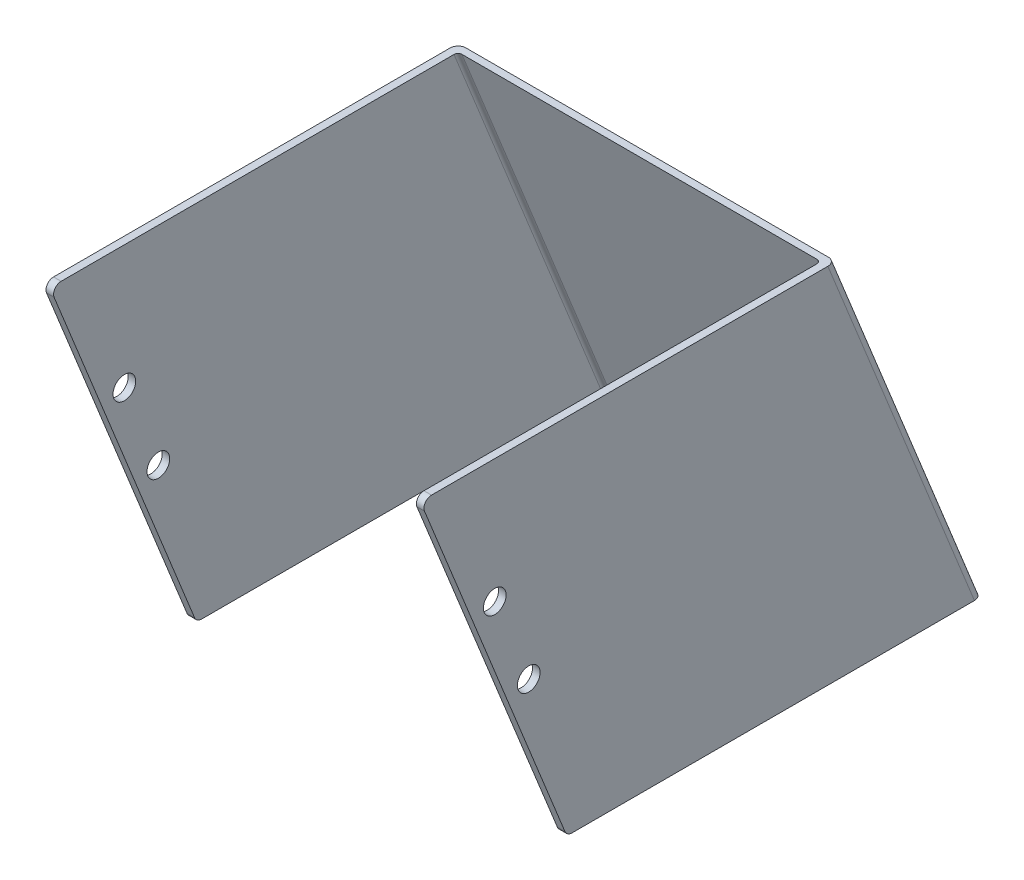
ISO-10303-21;
HEADER;
FILE_DESCRIPTION(('STEP AP214'),'2;1');
FILE_NAME('part.step','',(''),(''),'','','');
FILE_SCHEMA(('AUTOMOTIVE_DESIGN { 1 0 10303 214 1 1 1 1 }'));
ENDSEC;
DATA;
#1=APPLICATION_CONTEXT('core data for automotive mechanical design processes');
#2=APPLICATION_PROTOCOL_DEFINITION('international standard','automotive_design',2000,#1);
#3=PRODUCT_CONTEXT('',#1,'mechanical');
#4=PRODUCT('Part','Part','',(#3));
#5=PRODUCT_RELATED_PRODUCT_CATEGORY('part','',(#4));
#6=PRODUCT_DEFINITION_FORMATION('','',#4);
#7=PRODUCT_DEFINITION_CONTEXT('part definition',#1,'design');
#8=PRODUCT_DEFINITION('design','',#6,#7);
#9=PRODUCT_DEFINITION_SHAPE('','',#8);
#10=(LENGTH_UNIT() NAMED_UNIT(*) SI_UNIT(.MILLI.,.METRE.));
#11=(NAMED_UNIT(*) PLANE_ANGLE_UNIT() SI_UNIT($,.RADIAN.));
#12=(NAMED_UNIT(*) SI_UNIT($,.STERADIAN.) SOLID_ANGLE_UNIT());
#13=UNCERTAINTY_MEASURE_WITH_UNIT(LENGTH_MEASURE(1.E-05),#10,'distance_accuracy_value','');
#14=(GEOMETRIC_REPRESENTATION_CONTEXT(3) GLOBAL_UNCERTAINTY_ASSIGNED_CONTEXT((#13)) GLOBAL_UNIT_ASSIGNED_CONTEXT((#10,
#11,#12)) REPRESENTATION_CONTEXT('',''));
#15=CARTESIAN_POINT('',(0.,0.,0.));
#16=DIRECTION('',(0.,0.,1.));
#17=DIRECTION('',(1.,0.,0.));
#18=AXIS2_PLACEMENT_3D('',#15,#16,#17);
#19=CARTESIAN_POINT('',(-79.375,-87.3125,-45.5495832672248));
#20=DIRECTION('',(1.,0.,0.));
#21=DIRECTION('',(0.,0.,-1.));
#22=AXIS2_PLACEMENT_3D('',#19,#20,#21);
#23=CYLINDRICAL_SURFACE('',#22,4.7625);
#24=CARTESIAN_POINT('',(-76.2,-87.3125,-45.5495832672248));
#25=DIRECTION('',(1.,0.,0.));
#26=DIRECTION('',(0.,0.,-1.));
#27=AXIS2_PLACEMENT_3D('',#24,#25,#26);
#28=CIRCLE('',#27,4.7625);
#29=CARTESIAN_POINT('',(-76.2,-87.3125,-50.3120832672248));
#30=VERTEX_POINT('',#29);
#31=EDGE_CURVE('E144',#30,#30,#28,.F.);
#32=ORIENTED_EDGE('',*,*,#31,.F.);
#33=EDGE_LOOP('',(#32));
#34=FACE_BOUND('',#33,.T.);
#35=CARTESIAN_POINT('',(-79.375,-87.3125,-45.5495832672248));
#36=DIRECTION('',(1.,0.,0.));
#37=DIRECTION('',(0.,0.,-1.));
#38=AXIS2_PLACEMENT_3D('',#35,#36,#37);
#39=CIRCLE('',#38,4.7625);
#40=CARTESIAN_POINT('',(-79.375,-87.3125,-50.3120832672248));
#41=VERTEX_POINT('',#40);
#42=EDGE_CURVE('E224',#41,#41,#39,.F.);
#43=ORIENTED_EDGE('',*,*,#42,.T.);
#44=EDGE_LOOP('',(#43));
#45=FACE_BOUND('',#44,.T.);
#46=ADVANCED_FACE('F16',(#34,#45),#23,.F.);
#47=CARTESIAN_POINT('',(-79.375,-51.98679514101,-31.2770720581006));
#48=DIRECTION('',(1.,0.,0.));
#49=DIRECTION('',(0.,0.,-1.));
#50=AXIS2_PLACEMENT_3D('',#47,#48,#49);
#51=CYLINDRICAL_SURFACE('',#50,4.7625);
#52=CARTESIAN_POINT('',(-76.2,-51.98679514101,-31.2770720581006));
#53=DIRECTION('',(1.,0.,0.));
#54=DIRECTION('',(0.,0.,-1.));
#55=AXIS2_PLACEMENT_3D('',#52,#53,#54);
#56=CIRCLE('',#55,4.7625);
#57=CARTESIAN_POINT('',(-76.2,-51.98679514101,-36.0395720581006));
#58=VERTEX_POINT('',#57);
#59=EDGE_CURVE('E231',#58,#58,#56,.F.);
#60=ORIENTED_EDGE('',*,*,#59,.F.);
#61=EDGE_LOOP('',(#60));
#62=FACE_BOUND('',#61,.T.);
#63=CARTESIAN_POINT('',(-79.375,-51.98679514101,-31.2770720581006));
#64=DIRECTION('',(1.,0.,0.));
#65=DIRECTION('',(0.,0.,-1.));
#66=AXIS2_PLACEMENT_3D('',#63,#64,#65);
#67=CIRCLE('',#66,4.7625);
#68=CARTESIAN_POINT('',(-79.375,-51.98679514101,-36.0395720581006));
#69=VERTEX_POINT('',#68);
#70=EDGE_CURVE('E158',#69,#69,#67,.F.);
#71=ORIENTED_EDGE('',*,*,#70,.T.);
#72=EDGE_LOOP('',(#71));
#73=FACE_BOUND('',#72,.T.);
#74=ADVANCED_FACE('F239',(#62,#73),#51,.F.);
#75=CARTESIAN_POINT('',(-79.375,0.,0.));
#76=DIRECTION('',(0.,-0.374606593415897,0.927183854566793));
#77=DIRECTION('',(0.,-0.927183854566793,-0.374606593415897));
#78=AXIS2_PLACEMENT_3D('',#75,#76,#77);
#79=PLANE('',#78);
#80=DIRECTION('',(0.,-0.927183854566809,-0.374606593415858));
#81=VECTOR('',#80,1.);
#82=CARTESIAN_POINT('',(-79.375,-4.3643759340958,-1.7633223367783));
#83=LINE('',#82,#81);
#84=CARTESIAN_POINT('',(-79.375,-4.36437593409558,-1.76332233677841));
#85=VERTEX_POINT('',#84);
#86=CARTESIAN_POINT('',(-79.375,-150.414375934096,-60.7713526199949));
#87=VERTEX_POINT('',#86);
#88=EDGE_CURVE('E132',#85,#87,#83,.T.);
#89=ORIENTED_EDGE('',*,*,#88,.T.);
#90=DIRECTION('',(-1.,0.,0.));
#91=VECTOR('',#90,1.);
#92=CARTESIAN_POINT('',(286.3215,-150.414375934094,-60.7713526199964));
#93=LINE('',#92,#91);
#94=CARTESIAN_POINT('',(-76.2,-150.414375934096,-60.7713526199949));
#95=VERTEX_POINT('',#94);
#96=EDGE_CURVE('E125',#95,#87,#93,.T.);
#97=ORIENTED_EDGE('',*,*,#96,.F.);
#98=DIRECTION('',(0.,-0.927183854566809,-0.374606593415858));
#99=VECTOR('',#98,1.);
#100=CARTESIAN_POINT('',(-76.2,-4.3643759340958,-1.7633223367783));
#101=LINE('',#100,#99);
#102=CARTESIAN_POINT('',(-76.2,-4.36437593409558,-1.76332233677841));
#103=VERTEX_POINT('',#102);
#104=EDGE_CURVE('E129',#103,#95,#101,.T.);
#105=ORIENTED_EDGE('',*,*,#104,.F.);
#106=DIRECTION('',(-1.,0.,0.));
#107=VECTOR('',#106,1.);
#108=CARTESIAN_POINT('',(286.3215,-4.36437593409566,-1.76332233677865));
#109=LINE('',#108,#107);
#110=EDGE_CURVE('E157',#85,#103,#109,.F.);
#111=ORIENTED_EDGE('',*,*,#110,.F.);
#112=EDGE_LOOP('',(#89,#97,#105,#111));
#113=FACE_BOUND('',#112,.T.);
#114=ADVANCED_FACE('F127',(#113),#79,.T.);
#115=CARTESIAN_POINT('',(286.3215,-149.225,-63.7151613582464));
#116=DIRECTION('',(-1.,0.,0.));
#117=DIRECTION('',(0.,0.,1.));
#118=AXIS2_PLACEMENT_3D('',#115,#116,#117);
#119=CYLINDRICAL_SURFACE('',#118,3.175);
#120=ORIENTED_EDGE('',*,*,#96,.T.);
#121=CARTESIAN_POINT('',(-79.375,-149.225,-63.7151613582464));
#122=DIRECTION('',(-1.,0.,0.));
#123=DIRECTION('',(0.,0.,1.));
#124=AXIS2_PLACEMENT_3D('',#121,#122,#123);
#125=CIRCLE('',#124,3.175);
#126=CARTESIAN_POINT('',(-79.375,-152.4,-63.7151613582464));
#127=VERTEX_POINT('',#126);
#128=EDGE_CURVE('E227',#87,#127,#125,.F.);
#129=ORIENTED_EDGE('',*,*,#128,.T.);
#130=DIRECTION('',(1.,0.,0.));
#131=VECTOR('',#130,1.);
#132=CARTESIAN_POINT('',(-79.375,-152.4,-63.7151613582464));
#133=LINE('',#132,#131);
#134=CARTESIAN_POINT('',(-76.2,-152.4,-63.7151613582464));
#135=VERTEX_POINT('',#134);
#136=EDGE_CURVE('E140',#135,#127,#133,.F.);
#137=ORIENTED_EDGE('',*,*,#136,.F.);
#138=CARTESIAN_POINT('',(-76.2,-149.225,-63.7151613582464));
#139=DIRECTION('',(-1.,0.,0.));
#140=DIRECTION('',(0.,0.,1.));
#141=AXIS2_PLACEMENT_3D('',#138,#139,#140);
#142=CIRCLE('',#141,3.175);
#143=EDGE_CURVE('E19',#95,#135,#142,.F.);
#144=ORIENTED_EDGE('',*,*,#143,.F.);
#145=EDGE_LOOP('',(#120,#129,#137,#144));
#146=FACE_BOUND('',#145,.T.);
#147=ADVANCED_FACE('F138',(#146),#119,.T.);
#148=CARTESIAN_POINT('',(-76.2,0.,0.));
#149=DIRECTION('',(1.,0.,0.));
#150=DIRECTION('',(0.,0.,-1.));
#151=AXIS2_PLACEMENT_3D('',#148,#149,#150);
#152=PLANE('',#151);
#153=ORIENTED_EDGE('',*,*,#59,.T.);
#154=EDGE_LOOP('',(#153));
#155=FACE_BOUND('',#154,.T.);
#156=ORIENTED_EDGE('',*,*,#31,.T.);
#157=EDGE_LOOP('',(#156));
#158=FACE_BOUND('',#157,.T.);
#159=ORIENTED_EDGE('',*,*,#104,.T.);
#160=ORIENTED_EDGE('',*,*,#143,.T.);
#161=DIRECTION('',(0.,0.,-1.));
#162=VECTOR('',#161,1.);
#163=CARTESIAN_POINT('',(-76.2,-152.4,-61.5735968172794));
#164=LINE('',#163,#162);
#165=CARTESIAN_POINT('',(-76.2,-152.4,-231.311422913274));
#166=VERTEX_POINT('',#165);
#167=EDGE_CURVE('E156',#166,#135,#164,.F.);
#168=ORIENTED_EDGE('',*,*,#167,.F.);
#169=DIRECTION('',(0.,-0.927183854566793,-0.374606593415897));
#170=VECTOR('',#169,1.);
#171=CARTESIAN_POINT('',(-76.2,198.668640000009,-89.4704852850089));
#172=LINE('',#171,#170);
#173=CARTESIAN_POINT('',(-76.2,0.,-169.737826095999));
#174=VERTEX_POINT('',#173);
#175=EDGE_CURVE('E152',#166,#174,#172,.F.);
#176=ORIENTED_EDGE('',*,*,#175,.T.);
#177=DIRECTION('',(0.,0.,1.));
#178=VECTOR('',#177,1.);
#179=CARTESIAN_POINT('',(-76.2,0.,-174.625));
#180=LINE('',#179,#178);
#181=CARTESIAN_POINT('',(-76.2,0.,-4.70713107502815));
#182=VERTEX_POINT('',#181);
#183=EDGE_CURVE('E200',#182,#174,#180,.F.);
#184=ORIENTED_EDGE('',*,*,#183,.F.);
#185=CARTESIAN_POINT('',(-76.2,-3.175,-4.70713107502814));
#186=DIRECTION('',(-1.,0.,0.));
#187=DIRECTION('',(0.,0.,1.));
#188=AXIS2_PLACEMENT_3D('',#185,#186,#187);
#189=CIRCLE('',#188,3.175);
#190=EDGE_CURVE('E147',#103,#182,#189,.T.);
#191=ORIENTED_EDGE('',*,*,#190,.F.);
#192=EDGE_LOOP('',(#159,#160,#168,#176,#184,#191));
#193=FACE_BOUND('',#192,.T.);
#194=ADVANCED_FACE('F145',(#155,#158,#193),#152,.T.);
#195=CARTESIAN_POINT('',(-74.6125,198.66864,-89.470485284986));
#196=DIRECTION('',(0.,-0.927183854566793,-0.374606593415897));
#197=DIRECTION('',(0.,0.374606593415897,-0.927183854566793));
#198=AXIS2_PLACEMENT_3D('',#195,#196,#197);
#199=CYLINDRICAL_SURFACE('',#198,1.5875);
#200=DIRECTION('',(0.,0.927183854566793,0.374606593415897));
#201=VECTOR('',#200,1.);
#202=CARTESIAN_POINT('',(-74.6125,-152.4,-233.023596817279));
#203=LINE('',#202,#201);
#204=CARTESIAN_POINT('',(-74.6125,-152.4,-233.02359681727));
#205=VERTEX_POINT('',#204);
#206=CARTESIAN_POINT('',(-74.6125,0.,-171.449999999995));
#207=VERTEX_POINT('',#206);
#208=EDGE_CURVE('E290',#205,#207,#203,.T.);
#209=ORIENTED_EDGE('',*,*,#208,.T.);
#210=CARTESIAN_POINT('',(-74.6125,0.,-169.737826095986));
#211=DIRECTION('',(0.,1.,0.));
#212=DIRECTION('',(0.,0.,-1.));
#213=AXIS2_PLACEMENT_3D('',#210,#211,#212);
#214=ELLIPSE('',#213,1.71217390400065,1.5875);
#215=EDGE_CURVE('E197',#174,#207,#214,.F.);
#216=ORIENTED_EDGE('',*,*,#215,.F.);
#217=ORIENTED_EDGE('',*,*,#175,.F.);
#218=CARTESIAN_POINT('',(-74.6125,-152.4,-231.311422913261));
#219=DIRECTION('',(0.,-1.,0.));
#220=DIRECTION('',(0.,0.,-1.));
#221=AXIS2_PLACEMENT_3D('',#218,#219,#220);
#222=ELLIPSE('',#221,1.71217390400065,1.5875);
#223=EDGE_CURVE('E209',#205,#166,#222,.F.);
#224=ORIENTED_EDGE('',*,*,#223,.F.);
#225=EDGE_LOOP('',(#209,#216,#217,#224));
#226=FACE_BOUND('',#225,.T.);
#227=ADVANCED_FACE('F295',(#226),#199,.F.);
#228=CARTESIAN_POINT('',(-76.2,-152.4,-233.023596817279));
#229=DIRECTION('',(0.,0.374606593415897,-0.927183854566793));
#230=DIRECTION('',(0.,0.927183854566793,0.374606593415897));
#231=AXIS2_PLACEMENT_3D('',#228,#229,#230);
#232=PLANE('',#231);
#233=DIRECTION('',(0.,0.927183854566793,0.374606593415897));
#234=VECTOR('',#233,1.);
#235=CARTESIAN_POINT('',(74.6125,-350.473952032952,-313.050668093511));
#236=LINE('',#235,#234);
#237=CARTESIAN_POINT('',(74.6125,-152.399999999991,-233.023596817356));
#238=VERTEX_POINT('',#237);
#239=CARTESIAN_POINT('',(74.6125,9.70057367766231E-12,-171.45000000008));
#240=VERTEX_POINT('',#239);
#241=EDGE_CURVE('E288',#238,#240,#236,.T.);
#242=ORIENTED_EDGE('',*,*,#241,.T.);
#243=DIRECTION('',(1.,0.,0.));
#244=VECTOR('',#243,1.);
#245=CARTESIAN_POINT('',(-79.375,0.,-171.45));
#246=LINE('',#245,#244);
#247=EDGE_CURVE('E196',#207,#240,#246,.T.);
#248=ORIENTED_EDGE('',*,*,#247,.F.);
#249=ORIENTED_EDGE('',*,*,#208,.F.);
#250=DIRECTION('',(1.,0.,0.));
#251=VECTOR('',#250,1.);
#252=CARTESIAN_POINT('',(-79.375,-152.4,-233.023596817279));
#253=LINE('',#252,#251);
#254=EDGE_CURVE('E212',#238,#205,#253,.F.);
#255=ORIENTED_EDGE('',*,*,#254,.F.);
#256=EDGE_LOOP('',(#242,#248,#249,#255));
#257=FACE_BOUND('',#256,.T.);
#258=ADVANCED_FACE('F298',(#257),#232,.F.);
#259=CARTESIAN_POINT('',(74.6125,-351.06864,-311.578763724386));
#260=DIRECTION('',(0.,0.927183854566793,0.374606593415897));
#261=DIRECTION('',(0.,-0.374606593415897,0.927183854566793));
#262=AXIS2_PLACEMENT_3D('',#259,#260,#261);
#263=CYLINDRICAL_SURFACE('',#262,1.5875);
#264=ORIENTED_EDGE('',*,*,#241,.F.);
#265=CARTESIAN_POINT('',(74.6125,-152.4,-231.311422913386));
#266=DIRECTION('',(0.,-1.,0.));
#267=DIRECTION('',(0.,0.,1.));
#268=AXIS2_PLACEMENT_3D('',#265,#266,#267);
#269=ELLIPSE('',#268,1.71217390400065,1.5875);
#270=CARTESIAN_POINT('',(76.2,-152.4,-231.311422913337));
#271=VERTEX_POINT('',#270);
#272=EDGE_CURVE('E213',#271,#238,#269,.F.);
#273=ORIENTED_EDGE('',*,*,#272,.F.);
#274=DIRECTION('',(0.,0.927183854566784,0.37460659341592));
#275=VECTOR('',#274,1.);
#276=CARTESIAN_POINT('',(76.2,-152.4,-231.311422913288));
#277=LINE('',#276,#275);
#278=CARTESIAN_POINT('',(76.2,0.,-169.73782609606));
#279=VERTEX_POINT('',#278);
#280=EDGE_CURVE('E220',#271,#279,#277,.T.);
#281=ORIENTED_EDGE('',*,*,#280,.T.);
#282=CARTESIAN_POINT('',(74.6125,0.,-169.737826096111));
#283=DIRECTION('',(0.,1.,0.));
#284=DIRECTION('',(0.,0.,1.));
#285=AXIS2_PLACEMENT_3D('',#282,#283,#284);
#286=ELLIPSE('',#285,1.71217390400065,1.5875);
#287=EDGE_CURVE('E193',#240,#279,#286,.F.);
#288=ORIENTED_EDGE('',*,*,#287,.F.);
#289=EDGE_LOOP('',(#264,#273,#281,#288));
#290=FACE_BOUND('',#289,.T.);
#291=ADVANCED_FACE('F302',(#290),#263,.F.);
#292=CARTESIAN_POINT('',(-79.375,-152.4,-236.198596817279));
#293=DIRECTION('',(0.,0.374606593415897,-0.927183854566793));
#294=DIRECTION('',(0.,0.927183854566793,0.374606593415897));
#295=AXIS2_PLACEMENT_3D('',#292,#293,#294);
#296=PLANE('',#295);
#297=DIRECTION('',(1.,0.,0.));
#298=VECTOR('',#297,1.);
#299=CARTESIAN_POINT('',(-79.375,-152.4,-236.198596817279));
#300=LINE('',#299,#298);
#301=CARTESIAN_POINT('',(-76.2,-152.400000000001,-236.198596817273));
#302=VERTEX_POINT('',#301);
#303=CARTESIAN_POINT('',(76.2,-152.399999999996,-236.198596817308));
#304=VERTEX_POINT('',#303);
#305=EDGE_CURVE('E205',#302,#304,#300,.T.);
#306=ORIENTED_EDGE('',*,*,#305,.F.);
#307=DIRECTION('',(0.,-0.927183854566793,-0.374606593415897));
#308=VECTOR('',#307,1.);
#309=CARTESIAN_POINT('',(-76.2,199.858015934095,-93.8771201192438));
#310=LINE('',#309,#308);
#311=CARTESIAN_POINT('',(-76.2,-4.02455846426619E-13,-174.624999999997));
#312=VERTEX_POINT('',#311);
#313=EDGE_CURVE('E230',#312,#302,#310,.T.);
#314=ORIENTED_EDGE('',*,*,#313,.F.);
#315=DIRECTION('',(1.,0.,0.));
#316=VECTOR('',#315,1.);
#317=CARTESIAN_POINT('',(-79.375,0.,-174.625));
#318=LINE('',#317,#316);
#319=CARTESIAN_POINT('',(76.2,3.8441472227646E-12,-174.625000000032));
#320=VERTEX_POINT('',#319);
#321=EDGE_CURVE('E188',#320,#312,#318,.F.);
#322=ORIENTED_EDGE('',*,*,#321,.F.);
#323=DIRECTION('',(0.,0.927183854566793,0.374606593415897));
#324=VECTOR('',#323,1.);
#325=CARTESIAN_POINT('',(76.2,-349.879264065905,-315.985398558568));
#326=LINE('',#325,#324);
#327=EDGE_CURVE('E204',#304,#320,#326,.T.);
#328=ORIENTED_EDGE('',*,*,#327,.F.);
#329=EDGE_LOOP('',(#306,#314,#322,#328));
#330=FACE_BOUND('',#329,.T.);
#331=ADVANCED_FACE('F339',(#330),#296,.T.);
#332=CARTESIAN_POINT('',(-76.2,198.66864,-90.9333113809942));
#333=DIRECTION('',(0.,-0.927183854566793,-0.374606593415897));
#334=DIRECTION('',(0.,0.374606593415897,-0.927183854566793));
#335=AXIS2_PLACEMENT_3D('',#332,#333,#334);
#336=CYLINDRICAL_SURFACE('',#335,3.175);
#337=ORIENTED_EDGE('',*,*,#313,.T.);
#338=CARTESIAN_POINT('',(-76.2,-152.4,-232.774249009269));
#339=DIRECTION('',(0.,-1.,0.));
#340=DIRECTION('',(0.,0.,-1.));
#341=AXIS2_PLACEMENT_3D('',#338,#339,#340);
#342=ELLIPSE('',#341,3.42434780800131,3.175);
#343=CARTESIAN_POINT('',(-79.375,-152.4,-232.77424900927));
#344=VERTEX_POINT('',#343);
#345=EDGE_CURVE('E206',#344,#302,#342,.T.);
#346=ORIENTED_EDGE('',*,*,#345,.F.);
#347=DIRECTION('',(0.,0.927183854566784,0.37460659341592));
#348=VECTOR('',#347,1.);
#349=CARTESIAN_POINT('',(-79.375,-152.4,-232.77424900927));
#350=LINE('',#349,#348);
#351=CARTESIAN_POINT('',(-79.375,0.,-171.200652191992));
#352=VERTEX_POINT('',#351);
#353=EDGE_CURVE('E229',#344,#352,#350,.T.);
#354=ORIENTED_EDGE('',*,*,#353,.T.);
#355=CARTESIAN_POINT('',(-76.2,0.,-171.200652191994));
#356=DIRECTION('',(0.,1.,0.));
#357=DIRECTION('',(0.,0.,-1.));
#358=AXIS2_PLACEMENT_3D('',#355,#356,#357);
#359=ELLIPSE('',#358,3.42434780800131,3.175);
#360=EDGE_CURVE('E184',#312,#352,#359,.T.);
#361=ORIENTED_EDGE('',*,*,#360,.F.);
#362=EDGE_LOOP('',(#337,#346,#354,#361));
#363=FACE_BOUND('',#362,.T.);
#364=ADVANCED_FACE('F246',(#363),#336,.T.);
#365=CARTESIAN_POINT('',(-79.375,0.,0.));
#366=DIRECTION('',(1.,0.,0.));
#367=DIRECTION('',(0.,0.,-1.));
#368=AXIS2_PLACEMENT_3D('',#365,#366,#367);
#369=PLANE('',#368);
#370=ORIENTED_EDGE('',*,*,#70,.F.);
#371=EDGE_LOOP('',(#370));
#372=FACE_BOUND('',#371,.T.);
#373=ORIENTED_EDGE('',*,*,#42,.F.);
#374=EDGE_LOOP('',(#373));
#375=FACE_BOUND('',#374,.T.);
#376=CARTESIAN_POINT('',(-79.375,-3.175,-4.70713107502814));
#377=DIRECTION('',(-1.,0.,0.));
#378=DIRECTION('',(0.,0.,1.));
#379=AXIS2_PLACEMENT_3D('',#376,#377,#378);
#380=CIRCLE('',#379,3.175);
#381=CARTESIAN_POINT('',(-79.375,0.,-4.70713107502815));
#382=VERTEX_POINT('',#381);
#383=EDGE_CURVE('E217',#382,#85,#380,.F.);
#384=ORIENTED_EDGE('',*,*,#383,.F.);
#385=DIRECTION('',(0.,0.,1.));
#386=VECTOR('',#385,1.);
#387=CARTESIAN_POINT('',(-79.375,0.,-174.625));
#388=LINE('',#387,#386);
#389=EDGE_CURVE('E187',#352,#382,#388,.T.);
#390=ORIENTED_EDGE('',*,*,#389,.F.);
#391=ORIENTED_EDGE('',*,*,#353,.F.);
#392=DIRECTION('',(0.,0.,-1.));
#393=VECTOR('',#392,1.);
#394=CARTESIAN_POINT('',(-79.375,-152.4,-61.5735968172794));
#395=LINE('',#394,#393);
#396=EDGE_CURVE('E155',#127,#344,#395,.T.);
#397=ORIENTED_EDGE('',*,*,#396,.F.);
#398=ORIENTED_EDGE('',*,*,#128,.F.);
#399=ORIENTED_EDGE('',*,*,#88,.F.);
#400=EDGE_LOOP('',(#384,#390,#391,#397,#398,#399));
#401=FACE_BOUND('',#400,.T.);
#402=ADVANCED_FACE('F242',(#372,#375,#401),#369,.F.);
#403=CARTESIAN_POINT('',(286.3215,-3.175,-4.70713107502814));
#404=DIRECTION('',(-1.,0.,0.));
#405=DIRECTION('',(0.,0.,1.));
#406=AXIS2_PLACEMENT_3D('',#403,#404,#405);
#407=CYLINDRICAL_SURFACE('',#406,3.175);
#408=DIRECTION('',(1.,0.,0.));
#409=VECTOR('',#408,1.);
#410=CARTESIAN_POINT('',(-79.375,0.,-4.70713107502815));
#411=LINE('',#410,#409);
#412=EDGE_CURVE('E254',#382,#182,#411,.T.);
#413=ORIENTED_EDGE('',*,*,#412,.F.);
#414=ORIENTED_EDGE('',*,*,#383,.T.);
#415=ORIENTED_EDGE('',*,*,#110,.T.);
#416=ORIENTED_EDGE('',*,*,#190,.T.);
#417=EDGE_LOOP('',(#413,#414,#415,#416));
#418=FACE_BOUND('',#417,.T.);
#419=ADVANCED_FACE('F245',(#418),#407,.T.);
#420=CARTESIAN_POINT('',(76.2,0.,0.));
#421=DIRECTION('',(1.,0.,0.));
#422=DIRECTION('',(0.,0.,-1.));
#423=AXIS2_PLACEMENT_3D('',#420,#421,#422);
#424=PLANE('',#423);
#425=CARTESIAN_POINT('',(76.2,-51.98679514101,-31.2770720581006));
#426=DIRECTION('',(1.,0.,0.));
#427=DIRECTION('',(0.,0.,-1.));
#428=AXIS2_PLACEMENT_3D('',#425,#426,#427);
#429=CIRCLE('',#428,4.7625);
#430=CARTESIAN_POINT('',(76.2,-51.98679514101,-36.0395720581006));
#431=VERTEX_POINT('',#430);
#432=EDGE_CURVE('E170',#431,#431,#429,.T.);
#433=ORIENTED_EDGE('',*,*,#432,.T.);
#434=EDGE_LOOP('',(#433));
#435=FACE_BOUND('',#434,.T.);
#436=CARTESIAN_POINT('',(76.2,-87.3125,-45.5495832672248));
#437=DIRECTION('',(1.,0.,0.));
#438=DIRECTION('',(0.,0.,-1.));
#439=AXIS2_PLACEMENT_3D('',#436,#437,#438);
#440=CIRCLE('',#439,4.7625);
#441=CARTESIAN_POINT('',(76.2,-87.3125,-50.3120832672248));
#442=VERTEX_POINT('',#441);
#443=EDGE_CURVE('E174',#442,#442,#440,.T.);
#444=ORIENTED_EDGE('',*,*,#443,.T.);
#445=EDGE_LOOP('',(#444));
#446=FACE_BOUND('',#445,.T.);
#447=CARTESIAN_POINT('',(76.2,-3.175,-4.70713107502814));
#448=DIRECTION('',(-1.,0.,0.));
#449=DIRECTION('',(0.,0.,1.));
#450=AXIS2_PLACEMENT_3D('',#447,#448,#449);
#451=CIRCLE('',#450,3.175);
#452=CARTESIAN_POINT('',(76.2,0.,-4.70713107502814));
#453=VERTEX_POINT('',#452);
#454=CARTESIAN_POINT('',(76.2,-4.36437593409566,-1.76332233677838));
#455=VERTEX_POINT('',#454);
#456=EDGE_CURVE('E180',#453,#455,#451,.F.);
#457=ORIENTED_EDGE('',*,*,#456,.F.);
#458=DIRECTION('',(0.,0.,1.));
#459=VECTOR('',#458,1.);
#460=CARTESIAN_POINT('',(76.2,0.,-174.625));
#461=LINE('',#460,#459);
#462=EDGE_CURVE('E192',#279,#453,#461,.T.);
#463=ORIENTED_EDGE('',*,*,#462,.F.);
#464=ORIENTED_EDGE('',*,*,#280,.F.);
#465=DIRECTION('',(0.,0.,-1.));
#466=VECTOR('',#465,1.);
#467=CARTESIAN_POINT('',(76.2,-152.4,-61.5735968172794));
#468=LINE('',#467,#466);
#469=CARTESIAN_POINT('',(76.2,-152.4,-63.7151613582464));
#470=VERTEX_POINT('',#469);
#471=EDGE_CURVE('E216',#470,#271,#468,.T.);
#472=ORIENTED_EDGE('',*,*,#471,.F.);
#473=CARTESIAN_POINT('',(76.2,-149.225,-63.7151613582464));
#474=DIRECTION('',(-1.,0.,0.));
#475=DIRECTION('',(0.,0.,1.));
#476=AXIS2_PLACEMENT_3D('',#473,#474,#475);
#477=CIRCLE('',#476,3.175);
#478=CARTESIAN_POINT('',(76.2,-150.414375934094,-60.7713526199981));
#479=VERTEX_POINT('',#478);
#480=EDGE_CURVE('E177',#479,#470,#477,.F.);
#481=ORIENTED_EDGE('',*,*,#480,.F.);
#482=DIRECTION('',(0.,-0.927183854566793,-0.374606593415897));
#483=VECTOR('',#482,1.);
#484=CARTESIAN_POINT('',(76.2,0.,0.));
#485=LINE('',#484,#483);
#486=EDGE_CURVE('E282',#455,#479,#485,.T.);
#487=ORIENTED_EDGE('',*,*,#486,.F.);
#488=EDGE_LOOP('',(#457,#463,#464,#472,#481,#487));
#489=FACE_BOUND('',#488,.T.);
#490=ADVANCED_FACE('F306',(#435,#446,#489),#424,.F.);
#491=CARTESIAN_POINT('',(-79.375,-152.4,-61.5735968172794));
#492=DIRECTION('',(0.,-1.,0.));
#493=DIRECTION('',(0.,0.,-1.));
#494=AXIS2_PLACEMENT_3D('',#491,#492,#493);
#495=PLANE('',#494);
#496=DIRECTION('',(0.,0.,-1.));
#497=VECTOR('',#496,1.);
#498=CARTESIAN_POINT('',(79.375,-152.4,0.));
#499=LINE('',#498,#497);
#500=CARTESIAN_POINT('',(79.375,-152.4,-63.7151613582464));
#501=VERTEX_POINT('',#500);
#502=CARTESIAN_POINT('',(79.375,-152.4,-232.774249009294));
#503=VERTEX_POINT('',#502);
#504=EDGE_CURVE('E173',#501,#503,#499,.T.);
#505=ORIENTED_EDGE('',*,*,#504,.F.);
#506=DIRECTION('',(-1.,0.,0.));
#507=VECTOR('',#506,1.);
#508=CARTESIAN_POINT('',(286.3215,-152.4,-63.7151613582464));
#509=LINE('',#508,#507);
#510=EDGE_CURVE('E284',#470,#501,#509,.F.);
#511=ORIENTED_EDGE('',*,*,#510,.F.);
#512=ORIENTED_EDGE('',*,*,#471,.T.);
#513=ORIENTED_EDGE('',*,*,#272,.T.);
#514=ORIENTED_EDGE('',*,*,#254,.T.);
#515=ORIENTED_EDGE('',*,*,#223,.T.);
#516=ORIENTED_EDGE('',*,*,#167,.T.);
#517=ORIENTED_EDGE('',*,*,#136,.T.);
#518=ORIENTED_EDGE('',*,*,#396,.T.);
#519=ORIENTED_EDGE('',*,*,#345,.T.);
#520=ORIENTED_EDGE('',*,*,#305,.T.);
#521=CARTESIAN_POINT('',(76.2,-152.4,-232.774249009318));
#522=DIRECTION('',(0.,-1.,0.));
#523=DIRECTION('',(0.,0.,1.));
#524=AXIS2_PLACEMENT_3D('',#521,#522,#523);
#525=ELLIPSE('',#524,3.42434780800131,3.175);
#526=EDGE_CURVE('E201',#503,#304,#525,.F.);
#527=ORIENTED_EDGE('',*,*,#526,.F.);
#528=EDGE_LOOP('',(#505,#511,#512,#513,#514,#515,#516,#517,#518,#519,#520,#527));
#529=FACE_BOUND('',#528,.T.);
#530=ADVANCED_FACE('F332',(#529),#495,.T.);
#531=CARTESIAN_POINT('',(76.2,-351.06864,-313.041589820318));
#532=DIRECTION('',(0.,0.927183854566793,0.374606593415897));
#533=DIRECTION('',(0.,-0.374606593415897,0.927183854566793));
#534=AXIS2_PLACEMENT_3D('',#531,#532,#533);
#535=CYLINDRICAL_SURFACE('',#534,3.175);
#536=ORIENTED_EDGE('',*,*,#327,.T.);
#537=CARTESIAN_POINT('',(76.2,0.,-171.200652192043));
#538=DIRECTION('',(0.,1.,0.));
#539=DIRECTION('',(0.,0.,1.));
#540=AXIS2_PLACEMENT_3D('',#537,#538,#539);
#541=ELLIPSE('',#540,3.42434780800131,3.175);
#542=CARTESIAN_POINT('',(79.375,0.,-171.200652192017));
#543=VERTEX_POINT('',#542);
#544=EDGE_CURVE('E189',#543,#320,#541,.T.);
#545=ORIENTED_EDGE('',*,*,#544,.F.);
#546=DIRECTION('',(0.,0.927183854566784,0.37460659341592));
#547=VECTOR('',#546,1.);
#548=CARTESIAN_POINT('',(79.375,-152.4,-232.77424900927));
#549=LINE('',#548,#547);
#550=EDGE_CURVE('E270',#503,#543,#549,.T.);
#551=ORIENTED_EDGE('',*,*,#550,.F.);
#552=ORIENTED_EDGE('',*,*,#526,.T.);
#553=EDGE_LOOP('',(#536,#545,#551,#552));
#554=FACE_BOUND('',#553,.T.);
#555=ADVANCED_FACE('F336',(#554),#535,.T.);
#556=CARTESIAN_POINT('',(-79.375,0.,-174.625));
#557=DIRECTION('',(0.,1.,0.));
#558=DIRECTION('',(0.,0.,1.));
#559=AXIS2_PLACEMENT_3D('',#556,#557,#558);
#560=PLANE('',#559);
#561=ORIENTED_EDGE('',*,*,#389,.T.);
#562=ORIENTED_EDGE('',*,*,#412,.T.);
#563=ORIENTED_EDGE('',*,*,#183,.T.);
#564=ORIENTED_EDGE('',*,*,#215,.T.);
#565=ORIENTED_EDGE('',*,*,#247,.T.);
#566=ORIENTED_EDGE('',*,*,#287,.T.);
#567=ORIENTED_EDGE('',*,*,#462,.T.);
#568=DIRECTION('',(-1.,0.,0.));
#569=VECTOR('',#568,1.);
#570=CARTESIAN_POINT('',(286.3215,0.,-4.70713107502814));
#571=LINE('',#570,#569);
#572=CARTESIAN_POINT('',(79.375,0.,-4.70713107502814));
#573=VERTEX_POINT('',#572);
#574=EDGE_CURVE('E183',#573,#453,#571,.T.);
#575=ORIENTED_EDGE('',*,*,#574,.F.);
#576=DIRECTION('',(0.,0.,-1.));
#577=VECTOR('',#576,1.);
#578=CARTESIAN_POINT('',(79.375,0.,0.));
#579=LINE('',#578,#577);
#580=EDGE_CURVE('E169',#543,#573,#579,.F.);
#581=ORIENTED_EDGE('',*,*,#580,.F.);
#582=ORIENTED_EDGE('',*,*,#544,.T.);
#583=ORIENTED_EDGE('',*,*,#321,.T.);
#584=ORIENTED_EDGE('',*,*,#360,.T.);
#585=EDGE_LOOP('',(#561,#562,#563,#564,#565,#566,#567,#575,#581,#582,#583,#584));
#586=FACE_BOUND('',#585,.T.);
#587=ADVANCED_FACE('F258',(#586),#560,.T.);
#588=CARTESIAN_POINT('',(286.3215,-3.175,-4.70713107502814));
#589=DIRECTION('',(-1.,0.,0.));
#590=DIRECTION('',(0.,0.,1.));
#591=AXIS2_PLACEMENT_3D('',#588,#589,#590);
#592=CYLINDRICAL_SURFACE('',#591,3.175);
#593=ORIENTED_EDGE('',*,*,#574,.T.);
#594=ORIENTED_EDGE('',*,*,#456,.T.);
#595=DIRECTION('',(1.,0.,0.));
#596=VECTOR('',#595,1.);
#597=CARTESIAN_POINT('',(-79.375,-4.36437593409575,-1.76332233677841));
#598=LINE('',#597,#596);
#599=CARTESIAN_POINT('',(79.375,-4.36437593409562,-1.76332233677829));
#600=VERTEX_POINT('',#599);
#601=EDGE_CURVE('E182',#600,#455,#598,.F.);
#602=ORIENTED_EDGE('',*,*,#601,.F.);
#603=CARTESIAN_POINT('',(79.375,-3.175,-4.70713107502814));
#604=DIRECTION('',(-1.,0.,0.));
#605=DIRECTION('',(0.,0.,1.));
#606=AXIS2_PLACEMENT_3D('',#603,#604,#605);
#607=CIRCLE('',#606,3.175);
#608=EDGE_CURVE('E166',#573,#600,#607,.F.);
#609=ORIENTED_EDGE('',*,*,#608,.F.);
#610=EDGE_LOOP('',(#593,#594,#602,#609));
#611=FACE_BOUND('',#610,.T.);
#612=ADVANCED_FACE('F313',(#611),#592,.T.);
#613=CARTESIAN_POINT('',(-79.375,0.,0.));
#614=DIRECTION('',(0.,-0.374606593415897,0.927183854566793));
#615=DIRECTION('',(0.,-0.927183854566793,-0.374606593415897));
#616=AXIS2_PLACEMENT_3D('',#613,#614,#615);
#617=PLANE('',#616);
#618=ORIENTED_EDGE('',*,*,#486,.T.);
#619=DIRECTION('',(-1.,0.,0.));
#620=VECTOR('',#619,1.);
#621=CARTESIAN_POINT('',(286.3215,-150.414375934094,-60.7713526199964));
#622=LINE('',#621,#620);
#623=CARTESIAN_POINT('',(79.375,-150.414375934096,-60.7713526199949));
#624=VERTEX_POINT('',#623);
#625=EDGE_CURVE('E34',#624,#479,#622,.T.);
#626=ORIENTED_EDGE('',*,*,#625,.F.);
#627=DIRECTION('',(0.,-0.927183854566809,-0.374606593415858));
#628=VECTOR('',#627,1.);
#629=CARTESIAN_POINT('',(79.375,-4.3643759340958,-1.7633223367783));
#630=LINE('',#629,#628);
#631=EDGE_CURVE('E165',#600,#624,#630,.T.);
#632=ORIENTED_EDGE('',*,*,#631,.F.);
#633=ORIENTED_EDGE('',*,*,#601,.T.);
#634=EDGE_LOOP('',(#618,#626,#632,#633));
#635=FACE_BOUND('',#634,.T.);
#636=ADVANCED_FACE('F326',(#635),#617,.T.);
#637=CARTESIAN_POINT('',(286.3215,-149.225,-63.7151613582464));
#638=DIRECTION('',(-1.,0.,0.));
#639=DIRECTION('',(0.,0.,1.));
#640=AXIS2_PLACEMENT_3D('',#637,#638,#639);
#641=CYLINDRICAL_SURFACE('',#640,3.175);
#642=ORIENTED_EDGE('',*,*,#625,.T.);
#643=ORIENTED_EDGE('',*,*,#480,.T.);
#644=ORIENTED_EDGE('',*,*,#510,.T.);
#645=CARTESIAN_POINT('',(79.375,-149.225,-63.7151613582464));
#646=DIRECTION('',(-1.,0.,0.));
#647=DIRECTION('',(0.,0.,1.));
#648=AXIS2_PLACEMENT_3D('',#645,#646,#647);
#649=CIRCLE('',#648,3.175);
#650=EDGE_CURVE('E162',#624,#501,#649,.F.);
#651=ORIENTED_EDGE('',*,*,#650,.F.);
#652=EDGE_LOOP('',(#642,#643,#644,#651));
#653=FACE_BOUND('',#652,.T.);
#654=ADVANCED_FACE('F329',(#653),#641,.T.);
#655=CARTESIAN_POINT('',(79.375,-87.3125,-45.5495832672248));
#656=DIRECTION('',(1.,0.,0.));
#657=DIRECTION('',(0.,0.,-1.));
#658=AXIS2_PLACEMENT_3D('',#655,#656,#657);
#659=CYLINDRICAL_SURFACE('',#658,4.7625);
#660=ORIENTED_EDGE('',*,*,#443,.F.);
#661=EDGE_LOOP('',(#660));
#662=FACE_BOUND('',#661,.T.);
#663=CARTESIAN_POINT('',(79.375,-87.3125,-45.5495832672248));
#664=DIRECTION('',(1.,0.,0.));
#665=DIRECTION('',(0.,0.,-1.));
#666=AXIS2_PLACEMENT_3D('',#663,#664,#665);
#667=CIRCLE('',#666,4.7625);
#668=CARTESIAN_POINT('',(79.375,-87.3125,-50.3120832672248));
#669=VERTEX_POINT('',#668);
#670=EDGE_CURVE('E25',#669,#669,#667,.F.);
#671=ORIENTED_EDGE('',*,*,#670,.F.);
#672=EDGE_LOOP('',(#671));
#673=FACE_BOUND('',#672,.T.);
#674=ADVANCED_FACE('F357',(#662,#673),#659,.F.);
#675=CARTESIAN_POINT('',(79.375,-51.98679514101,-31.2770720581006));
#676=DIRECTION('',(1.,0.,0.));
#677=DIRECTION('',(0.,0.,-1.));
#678=AXIS2_PLACEMENT_3D('',#675,#676,#677);
#679=CYLINDRICAL_SURFACE('',#678,4.7625);
#680=ORIENTED_EDGE('',*,*,#432,.F.);
#681=EDGE_LOOP('',(#680));
#682=FACE_BOUND('',#681,.T.);
#683=CARTESIAN_POINT('',(79.375,-51.98679514101,-31.2770720581006));
#684=DIRECTION('',(1.,0.,0.));
#685=DIRECTION('',(0.,0.,-1.));
#686=AXIS2_PLACEMENT_3D('',#683,#684,#685);
#687=CIRCLE('',#686,4.7625);
#688=CARTESIAN_POINT('',(79.375,-51.98679514101,-36.0395720581006));
#689=VERTEX_POINT('',#688);
#690=EDGE_CURVE('E11',#689,#689,#687,.F.);
#691=ORIENTED_EDGE('',*,*,#690,.F.);
#692=EDGE_LOOP('',(#691));
#693=FACE_BOUND('',#692,.T.);
#694=ADVANCED_FACE('F351',(#682,#693),#679,.F.);
#695=CARTESIAN_POINT('',(79.375,0.,0.));
#696=DIRECTION('',(1.,0.,0.));
#697=DIRECTION('',(0.,0.,-1.));
#698=AXIS2_PLACEMENT_3D('',#695,#696,#697);
#699=PLANE('',#698);
#700=ORIENTED_EDGE('',*,*,#690,.T.);
#701=EDGE_LOOP('',(#700));
#702=FACE_BOUND('',#701,.T.);
#703=ORIENTED_EDGE('',*,*,#670,.T.);
#704=EDGE_LOOP('',(#703));
#705=FACE_BOUND('',#704,.T.);
#706=ORIENTED_EDGE('',*,*,#631,.T.);
#707=ORIENTED_EDGE('',*,*,#650,.T.);
#708=ORIENTED_EDGE('',*,*,#504,.T.);
#709=ORIENTED_EDGE('',*,*,#550,.T.);
#710=ORIENTED_EDGE('',*,*,#580,.T.);
#711=ORIENTED_EDGE('',*,*,#608,.T.);
#712=EDGE_LOOP('',(#706,#707,#708,#709,#710,#711));
#713=FACE_BOUND('',#712,.T.);
#714=ADVANCED_FACE('F317',(#702,#705,#713),#699,.T.);
#715=CLOSED_SHELL('',(#46,#74,#114,#147,#194,#227,#258,#291,#331,#364,#402,#419,#490,#530,#555,
#587,#612,#636,#654,#674,#694,#714));
#716=MANIFOLD_SOLID_BREP('B1',#715);
#717=ADVANCED_BREP_SHAPE_REPRESENTATION('',(#18,#716),#14);
#718=SHAPE_DEFINITION_REPRESENTATION(#9,#717);
ENDSEC;
END-ISO-10303-21;
